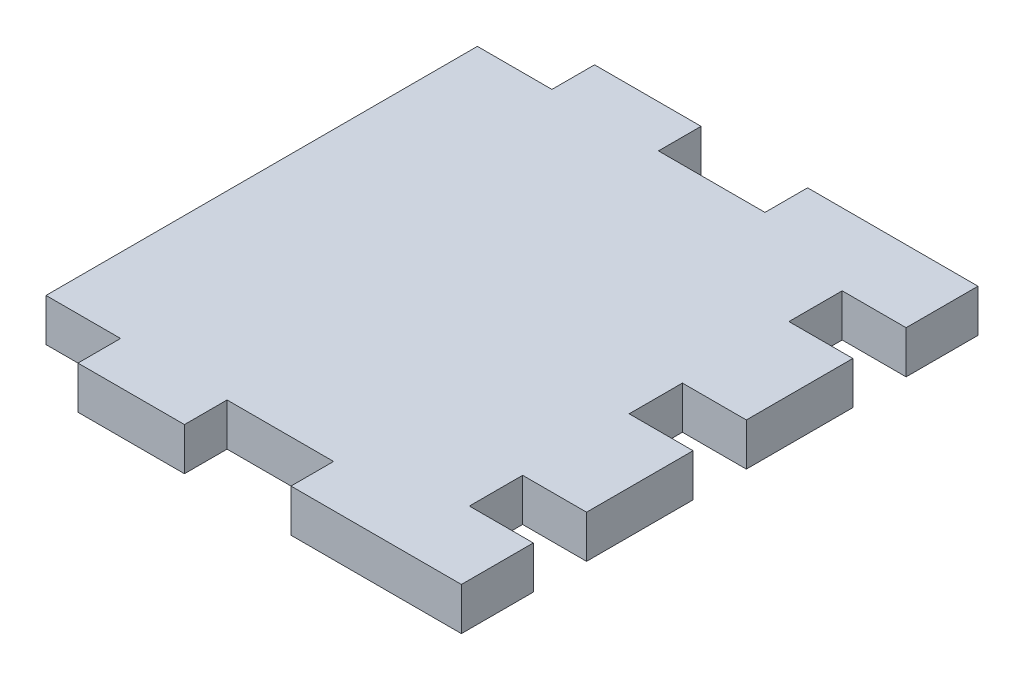
ISO-10303-21;
HEADER;
FILE_DESCRIPTION(('STEP AP214'),'2;1');
FILE_NAME('part.step','',(''),(''),'','','');
FILE_SCHEMA(('AUTOMOTIVE_DESIGN { 1 0 10303 214 1 1 1 1 }'));
ENDSEC;
DATA;
#1=APPLICATION_CONTEXT('core data for automotive mechanical design processes');
#2=APPLICATION_PROTOCOL_DEFINITION('international standard','automotive_design',2000,#1);
#3=PRODUCT_CONTEXT('',#1,'mechanical');
#4=PRODUCT('Part','Part','',(#3));
#5=PRODUCT_RELATED_PRODUCT_CATEGORY('part','',(#4));
#6=PRODUCT_DEFINITION_FORMATION('','',#4);
#7=PRODUCT_DEFINITION_CONTEXT('part definition',#1,'design');
#8=PRODUCT_DEFINITION('design','',#6,#7);
#9=PRODUCT_DEFINITION_SHAPE('','',#8);
#10=(LENGTH_UNIT() NAMED_UNIT(*) SI_UNIT(.MILLI.,.METRE.));
#11=(NAMED_UNIT(*) PLANE_ANGLE_UNIT() SI_UNIT($,.RADIAN.));
#12=(NAMED_UNIT(*) SI_UNIT($,.STERADIAN.) SOLID_ANGLE_UNIT());
#13=UNCERTAINTY_MEASURE_WITH_UNIT(LENGTH_MEASURE(1.E-05),#10,'distance_accuracy_value','');
#14=(GEOMETRIC_REPRESENTATION_CONTEXT(3) GLOBAL_UNCERTAINTY_ASSIGNED_CONTEXT((#13)) GLOBAL_UNIT_ASSIGNED_CONTEXT((#10,
#11,#12)) REPRESENTATION_CONTEXT('',''));
#15=CARTESIAN_POINT('',(0.,0.,0.));
#16=DIRECTION('',(0.,0.,1.));
#17=DIRECTION('',(1.,0.,0.));
#18=AXIS2_PLACEMENT_3D('',#15,#16,#17);
#19=CARTESIAN_POINT('',(37.,4.,0.));
#20=DIRECTION('',(-1.,0.,0.));
#21=DIRECTION('',(0.,0.,1.));
#22=AXIS2_PLACEMENT_3D('',#19,#20,#21);
#23=PLANE('',#22);
#24=DIRECTION('',(0.,1.,0.));
#25=VECTOR('',#24,1.);
#26=CARTESIAN_POINT('',(37.,4.,37.75));
#27=LINE('',#26,#25);
#28=CARTESIAN_POINT('',(37.,0.,37.75));
#29=VERTEX_POINT('',#28);
#30=CARTESIAN_POINT('',(37.,4.,37.75));
#31=VERTEX_POINT('',#30);
#32=EDGE_CURVE('E53',#29,#31,#27,.T.);
#33=ORIENTED_EDGE('',*,*,#32,.F.);
#34=DIRECTION('',(0.,0.,-1.));
#35=VECTOR('',#34,1.);
#36=CARTESIAN_POINT('',(37.,0.,0.));
#37=LINE('',#36,#35);
#38=CARTESIAN_POINT('',(37.,0.,32.75));
#39=VERTEX_POINT('',#38);
#40=EDGE_CURVE('E425',#29,#39,#37,.T.);
#41=ORIENTED_EDGE('',*,*,#40,.T.);
#42=DIRECTION('',(0.,-1.,0.));
#43=VECTOR('',#42,1.);
#44=CARTESIAN_POINT('',(37.,4.,32.75));
#45=LINE('',#44,#43);
#46=CARTESIAN_POINT('',(37.,4.,32.75));
#47=VERTEX_POINT('',#46);
#48=EDGE_CURVE('E244',#47,#39,#45,.T.);
#49=ORIENTED_EDGE('',*,*,#48,.F.);
#50=DIRECTION('',(0.,0.,-1.));
#51=VECTOR('',#50,1.);
#52=CARTESIAN_POINT('',(37.,4.,0.));
#53=LINE('',#52,#51);
#54=EDGE_CURVE('E48',#31,#47,#53,.T.);
#55=ORIENTED_EDGE('',*,*,#54,.F.);
#56=EDGE_LOOP('',(#33,#41,#49,#55));
#57=FACE_BOUND('',#56,.T.);
#58=ADVANCED_FACE('F33',(#57),#23,.F.);
#59=DIRECTION('',(0.,1.,0.));
#60=VECTOR('',#59,1.);
#61=CARTESIAN_POINT('',(37.,4.,22.75));
#62=LINE('',#61,#60);
#63=CARTESIAN_POINT('',(37.,0.,22.75));
#64=VERTEX_POINT('',#63);
#65=CARTESIAN_POINT('',(37.,4.,22.75));
#66=VERTEX_POINT('',#65);
#67=EDGE_CURVE('E240',#64,#66,#62,.T.);
#68=ORIENTED_EDGE('',*,*,#67,.F.);
#69=CARTESIAN_POINT('',(37.,0.,17.75));
#70=VERTEX_POINT('',#69);
#71=EDGE_CURVE('E428',#64,#70,#37,.T.);
#72=ORIENTED_EDGE('',*,*,#71,.T.);
#73=DIRECTION('',(0.,-1.,0.));
#74=VECTOR('',#73,1.);
#75=CARTESIAN_POINT('',(37.,0.,17.75));
#76=LINE('',#75,#74);
#77=CARTESIAN_POINT('',(37.,4.,17.75));
#78=VERTEX_POINT('',#77);
#79=EDGE_CURVE('E272',#78,#70,#76,.T.);
#80=ORIENTED_EDGE('',*,*,#79,.F.);
#81=EDGE_CURVE('E415',#66,#78,#53,.T.);
#82=ORIENTED_EDGE('',*,*,#81,.F.);
#83=EDGE_LOOP('',(#68,#72,#80,#82));
#84=FACE_BOUND('',#83,.T.);
#85=ADVANCED_FACE('F498',(#84),#23,.F.);
#86=DIRECTION('',(0.,1.,0.));
#87=VECTOR('',#86,1.);
#88=CARTESIAN_POINT('',(37.,0.,7.75000000000002));
#89=LINE('',#88,#87);
#90=CARTESIAN_POINT('',(37.,0.,7.75000000000002));
#91=VERTEX_POINT('',#90);
#92=CARTESIAN_POINT('',(37.,4.,7.75000000000002));
#93=VERTEX_POINT('',#92);
#94=EDGE_CURVE('E277',#91,#93,#89,.T.);
#95=ORIENTED_EDGE('',*,*,#94,.F.);
#96=CARTESIAN_POINT('',(37.,0.,2.75000000000002));
#97=VERTEX_POINT('',#96);
#98=EDGE_CURVE('E424',#91,#97,#37,.T.);
#99=ORIENTED_EDGE('',*,*,#98,.T.);
#100=DIRECTION('',(0.,-1.,0.));
#101=VECTOR('',#100,1.);
#102=CARTESIAN_POINT('',(37.,0.,2.75000000000002));
#103=LINE('',#102,#101);
#104=CARTESIAN_POINT('',(37.,4.,2.75000000000002));
#105=VERTEX_POINT('',#104);
#106=EDGE_CURVE('E299',#105,#97,#103,.T.);
#107=ORIENTED_EDGE('',*,*,#106,.F.);
#108=EDGE_CURVE('E412',#93,#105,#53,.T.);
#109=ORIENTED_EDGE('',*,*,#108,.F.);
#110=EDGE_LOOP('',(#95,#99,#107,#109));
#111=FACE_BOUND('',#110,.T.);
#112=ADVANCED_FACE('F482',(#111),#23,.F.);
#113=CARTESIAN_POINT('',(0.,4.,40.5));
#114=DIRECTION('',(0.,0.,-1.));
#115=DIRECTION('',(-1.,0.,0.));
#116=AXIS2_PLACEMENT_3D('',#113,#114,#115);
#117=PLANE('',#116);
#118=DIRECTION('',(1.,0.,0.));
#119=VECTOR('',#118,1.);
#120=CARTESIAN_POINT('',(0.,4.,40.5));
#121=LINE('',#120,#119);
#122=CARTESIAN_POINT('',(17.,4.,40.5));
#123=VERTEX_POINT('',#122);
#124=CARTESIAN_POINT('',(27.,4.,40.5));
#125=VERTEX_POINT('',#124);
#126=EDGE_CURVE('E407',#123,#125,#121,.T.);
#127=ORIENTED_EDGE('',*,*,#126,.F.);
#128=DIRECTION('',(0.,-1.,0.));
#129=VECTOR('',#128,1.);
#130=CARTESIAN_POINT('',(17.,4.,40.5));
#131=LINE('',#130,#129);
#132=CARTESIAN_POINT('',(17.,0.,40.5));
#133=VERTEX_POINT('',#132);
#134=EDGE_CURVE('E337',#123,#133,#131,.T.);
#135=ORIENTED_EDGE('',*,*,#134,.T.);
#136=DIRECTION('',(1.,0.,0.));
#137=VECTOR('',#136,1.);
#138=CARTESIAN_POINT('',(0.,0.,40.5));
#139=LINE('',#138,#137);
#140=CARTESIAN_POINT('',(27.,0.,40.5));
#141=VERTEX_POINT('',#140);
#142=EDGE_CURVE('E421',#133,#141,#139,.T.);
#143=ORIENTED_EDGE('',*,*,#142,.T.);
#144=DIRECTION('',(0.,-1.,0.));
#145=VECTOR('',#144,1.);
#146=CARTESIAN_POINT('',(27.,4.,40.5));
#147=LINE('',#146,#145);
#148=EDGE_CURVE('E385',#125,#141,#147,.T.);
#149=ORIENTED_EDGE('',*,*,#148,.F.);
#150=EDGE_LOOP('',(#127,#135,#143,#149));
#151=FACE_BOUND('',#150,.T.);
#152=ADVANCED_FACE('F522',(#151),#117,.F.);
#153=CARTESIAN_POINT('',(0.,4.,0.));
#154=DIRECTION('',(0.,0.,1.));
#155=DIRECTION('',(1.,0.,0.));
#156=AXIS2_PLACEMENT_3D('',#153,#154,#155);
#157=PLANE('',#156);
#158=DIRECTION('',(-1.,0.,0.));
#159=VECTOR('',#158,1.);
#160=CARTESIAN_POINT('',(0.,0.,0.));
#161=LINE('',#160,#159);
#162=CARTESIAN_POINT('',(27.,0.,0.));
#163=VERTEX_POINT('',#162);
#164=CARTESIAN_POINT('',(17.,0.,0.));
#165=VERTEX_POINT('',#164);
#166=EDGE_CURVE('E408',#163,#165,#161,.T.);
#167=ORIENTED_EDGE('',*,*,#166,.T.);
#168=DIRECTION('',(0.,-1.,0.));
#169=VECTOR('',#168,1.);
#170=CARTESIAN_POINT('',(17.,4.,0.));
#171=LINE('',#170,#169);
#172=CARTESIAN_POINT('',(17.,4.,0.));
#173=VERTEX_POINT('',#172);
#174=EDGE_CURVE('E357',#173,#165,#171,.T.);
#175=ORIENTED_EDGE('',*,*,#174,.F.);
#176=DIRECTION('',(-1.,0.,0.));
#177=VECTOR('',#176,1.);
#178=CARTESIAN_POINT('',(0.,4.,0.));
#179=LINE('',#178,#177);
#180=CARTESIAN_POINT('',(27.,4.,0.));
#181=VERTEX_POINT('',#180);
#182=EDGE_CURVE('E416',#181,#173,#179,.T.);
#183=ORIENTED_EDGE('',*,*,#182,.F.);
#184=DIRECTION('',(0.,-1.,0.));
#185=VECTOR('',#184,1.);
#186=CARTESIAN_POINT('',(27.,4.,0.));
#187=LINE('',#186,#185);
#188=EDGE_CURVE('E396',#181,#163,#187,.T.);
#189=ORIENTED_EDGE('',*,*,#188,.T.);
#190=EDGE_LOOP('',(#167,#175,#183,#189));
#191=FACE_BOUND('',#190,.T.);
#192=ADVANCED_FACE('F459',(#191),#157,.F.);
#193=CARTESIAN_POINT('',(0.,0.,40.5));
#194=VERTEX_POINT('',#193);
#195=CARTESIAN_POINT('',(7.,0.,40.5));
#196=VERTEX_POINT('',#195);
#197=EDGE_CURVE('E422',#194,#196,#139,.T.);
#198=ORIENTED_EDGE('',*,*,#197,.T.);
#199=DIRECTION('',(0.,-1.,0.));
#200=VECTOR('',#199,1.);
#201=CARTESIAN_POINT('',(7.,4.,40.5));
#202=LINE('',#201,#200);
#203=CARTESIAN_POINT('',(7.,4.,40.5));
#204=VERTEX_POINT('',#203);
#205=EDGE_CURVE('E341',#204,#196,#202,.T.);
#206=ORIENTED_EDGE('',*,*,#205,.F.);
#207=CARTESIAN_POINT('',(0.,4.,40.5));
#208=VERTEX_POINT('',#207);
#209=EDGE_CURVE('E409',#208,#204,#121,.T.);
#210=ORIENTED_EDGE('',*,*,#209,.F.);
#211=DIRECTION('',(0.,-1.,0.));
#212=VECTOR('',#211,1.);
#213=CARTESIAN_POINT('',(0.,4.,40.5));
#214=LINE('',#213,#212);
#215=EDGE_CURVE('E11',#208,#194,#214,.T.);
#216=ORIENTED_EDGE('',*,*,#215,.T.);
#217=EDGE_LOOP('',(#198,#206,#210,#216));
#218=FACE_BOUND('',#217,.T.);
#219=ADVANCED_FACE('F440',(#218),#117,.F.);
#220=CARTESIAN_POINT('',(0.,4.,0.));
#221=DIRECTION('',(1.,0.,0.));
#222=DIRECTION('',(0.,0.,-1.));
#223=AXIS2_PLACEMENT_3D('',#220,#221,#222);
#224=PLANE('',#223);
#225=DIRECTION('',(0.,0.,1.));
#226=VECTOR('',#225,1.);
#227=CARTESIAN_POINT('',(0.,0.,0.));
#228=LINE('',#227,#226);
#229=CARTESIAN_POINT('',(0.,0.,0.));
#230=VERTEX_POINT('',#229);
#231=EDGE_CURVE('E402',#230,#194,#228,.T.);
#232=ORIENTED_EDGE('',*,*,#231,.T.);
#233=ORIENTED_EDGE('',*,*,#215,.F.);
#234=DIRECTION('',(0.,0.,1.));
#235=VECTOR('',#234,1.);
#236=CARTESIAN_POINT('',(0.,4.,0.));
#237=LINE('',#236,#235);
#238=CARTESIAN_POINT('',(0.,4.,0.));
#239=VERTEX_POINT('',#238);
#240=EDGE_CURVE('E405',#239,#208,#237,.T.);
#241=ORIENTED_EDGE('',*,*,#240,.F.);
#242=DIRECTION('',(0.,-1.,0.));
#243=VECTOR('',#242,1.);
#244=CARTESIAN_POINT('',(0.,4.,0.));
#245=LINE('',#244,#243);
#246=EDGE_CURVE('E41',#239,#230,#245,.T.);
#247=ORIENTED_EDGE('',*,*,#246,.T.);
#248=EDGE_LOOP('',(#232,#233,#241,#247));
#249=FACE_BOUND('',#248,.T.);
#250=ADVANCED_FACE('F35',(#249),#224,.F.);
#251=CARTESIAN_POINT('',(7.,4.,0.));
#252=VERTEX_POINT('',#251);
#253=EDGE_CURVE('E414',#252,#239,#179,.T.);
#254=ORIENTED_EDGE('',*,*,#253,.F.);
#255=DIRECTION('',(0.,-1.,0.));
#256=VECTOR('',#255,1.);
#257=CARTESIAN_POINT('',(7.,4.,0.));
#258=LINE('',#257,#256);
#259=CARTESIAN_POINT('',(7.,0.,0.));
#260=VERTEX_POINT('',#259);
#261=EDGE_CURVE('E370',#252,#260,#258,.T.);
#262=ORIENTED_EDGE('',*,*,#261,.T.);
#263=EDGE_CURVE('E427',#260,#230,#161,.T.);
#264=ORIENTED_EDGE('',*,*,#263,.T.);
#265=ORIENTED_EDGE('',*,*,#246,.F.);
#266=EDGE_LOOP('',(#254,#262,#264,#265));
#267=FACE_BOUND('',#266,.T.);
#268=ADVANCED_FACE('F445',(#267),#157,.F.);
#269=CARTESIAN_POINT('',(0.,4.,0.));
#270=DIRECTION('',(0.,1.,0.));
#271=DIRECTION('',(0.,0.,1.));
#272=AXIS2_PLACEMENT_3D('',#269,#270,#271);
#273=PLANE('',#272);
#274=ORIENTED_EDGE('',*,*,#240,.T.);
#275=ORIENTED_EDGE('',*,*,#209,.T.);
#276=DIRECTION('',(0.,0.,-1.));
#277=VECTOR('',#276,1.);
#278=CARTESIAN_POINT('',(7.,4.,40.5));
#279=LINE('',#278,#277);
#280=CARTESIAN_POINT('',(7.,4.,44.5));
#281=VERTEX_POINT('',#280);
#282=EDGE_CURVE('E326',#281,#204,#279,.T.);
#283=ORIENTED_EDGE('',*,*,#282,.F.);
#284=DIRECTION('',(-1.,0.,0.));
#285=VECTOR('',#284,1.);
#286=CARTESIAN_POINT('',(17.,4.,44.5));
#287=LINE('',#286,#285);
#288=CARTESIAN_POINT('',(17.,4.,44.5));
#289=VERTEX_POINT('',#288);
#290=EDGE_CURVE('E322',#289,#281,#287,.T.);
#291=ORIENTED_EDGE('',*,*,#290,.F.);
#292=DIRECTION('',(0.,0.,1.));
#293=VECTOR('',#292,1.);
#294=CARTESIAN_POINT('',(17.,4.,40.5));
#295=LINE('',#294,#293);
#296=EDGE_CURVE('E319',#123,#289,#295,.T.);
#297=ORIENTED_EDGE('',*,*,#296,.F.);
#298=ORIENTED_EDGE('',*,*,#126,.T.);
#299=DIRECTION('',(0.,0.,-1.));
#300=VECTOR('',#299,1.);
#301=CARTESIAN_POINT('',(27.,4.,40.5));
#302=LINE('',#301,#300);
#303=CARTESIAN_POINT('',(27.,4.,44.5));
#304=VERTEX_POINT('',#303);
#305=EDGE_CURVE('E376',#304,#125,#302,.T.);
#306=ORIENTED_EDGE('',*,*,#305,.F.);
#307=DIRECTION('',(-1.,0.,0.));
#308=VECTOR('',#307,1.);
#309=CARTESIAN_POINT('',(37.,4.,44.5));
#310=LINE('',#309,#308);
#311=CARTESIAN_POINT('',(43.,4.,44.5));
#312=VERTEX_POINT('',#311);
#313=EDGE_CURVE('E224',#312,#304,#310,.T.);
#314=ORIENTED_EDGE('',*,*,#313,.F.);
#315=DIRECTION('',(0.,0.,1.));
#316=VECTOR('',#315,1.);
#317=CARTESIAN_POINT('',(43.,4.,37.75));
#318=LINE('',#317,#316);
#319=CARTESIAN_POINT('',(43.,4.,37.75));
#320=VERTEX_POINT('',#319);
#321=EDGE_CURVE('E216',#320,#312,#318,.T.);
#322=ORIENTED_EDGE('',*,*,#321,.F.);
#323=DIRECTION('',(-1.,0.,0.));
#324=VECTOR('',#323,1.);
#325=CARTESIAN_POINT('',(43.,4.,37.75));
#326=LINE('',#325,#324);
#327=EDGE_CURVE('E221',#320,#31,#326,.T.);
#328=ORIENTED_EDGE('',*,*,#327,.T.);
#329=ORIENTED_EDGE('',*,*,#54,.T.);
#330=DIRECTION('',(-1.,0.,0.));
#331=VECTOR('',#330,1.);
#332=CARTESIAN_POINT('',(43.,4.,32.75));
#333=LINE('',#332,#331);
#334=CARTESIAN_POINT('',(43.,4.,32.75));
#335=VERTEX_POINT('',#334);
#336=EDGE_CURVE('E266',#335,#47,#333,.T.);
#337=ORIENTED_EDGE('',*,*,#336,.F.);
#338=DIRECTION('',(0.,0.,1.));
#339=VECTOR('',#338,1.);
#340=CARTESIAN_POINT('',(43.,4.,22.75));
#341=LINE('',#340,#339);
#342=CARTESIAN_POINT('',(43.,4.,22.75));
#343=VERTEX_POINT('',#342);
#344=EDGE_CURVE('E252',#343,#335,#341,.T.);
#345=ORIENTED_EDGE('',*,*,#344,.F.);
#346=DIRECTION('',(-1.,0.,0.));
#347=VECTOR('',#346,1.);
#348=CARTESIAN_POINT('',(43.,4.,22.75));
#349=LINE('',#348,#347);
#350=EDGE_CURVE('E269',#343,#66,#349,.T.);
#351=ORIENTED_EDGE('',*,*,#350,.T.);
#352=ORIENTED_EDGE('',*,*,#81,.T.);
#353=DIRECTION('',(-1.,0.,0.));
#354=VECTOR('',#353,1.);
#355=CARTESIAN_POINT('',(43.,4.,17.75));
#356=LINE('',#355,#354);
#357=CARTESIAN_POINT('',(43.,4.,17.75));
#358=VERTEX_POINT('',#357);
#359=EDGE_CURVE('E283',#358,#78,#356,.T.);
#360=ORIENTED_EDGE('',*,*,#359,.F.);
#361=DIRECTION('',(0.,0.,1.));
#362=VECTOR('',#361,1.);
#363=CARTESIAN_POINT('',(43.,4.,17.75));
#364=LINE('',#363,#362);
#365=CARTESIAN_POINT('',(43.,4.,7.75000000000002));
#366=VERTEX_POINT('',#365);
#367=EDGE_CURVE('E281',#366,#358,#364,.T.);
#368=ORIENTED_EDGE('',*,*,#367,.F.);
#369=DIRECTION('',(-1.,0.,0.));
#370=VECTOR('',#369,1.);
#371=CARTESIAN_POINT('',(43.,4.,7.75000000000002));
#372=LINE('',#371,#370);
#373=EDGE_CURVE('E290',#366,#93,#372,.T.);
#374=ORIENTED_EDGE('',*,*,#373,.T.);
#375=ORIENTED_EDGE('',*,*,#108,.T.);
#376=DIRECTION('',(-1.,0.,0.));
#377=VECTOR('',#376,1.);
#378=CARTESIAN_POINT('',(43.,4.,2.75000000000002));
#379=LINE('',#378,#377);
#380=CARTESIAN_POINT('',(43.,4.,2.75000000000002));
#381=VERTEX_POINT('',#380);
#382=EDGE_CURVE('E315',#381,#105,#379,.T.);
#383=ORIENTED_EDGE('',*,*,#382,.F.);
#384=DIRECTION('',(0.,0.,1.));
#385=VECTOR('',#384,1.);
#386=CARTESIAN_POINT('',(43.,4.,-4.));
#387=LINE('',#386,#385);
#388=CARTESIAN_POINT('',(43.,4.,-4.));
#389=VERTEX_POINT('',#388);
#390=EDGE_CURVE('E303',#389,#381,#387,.T.);
#391=ORIENTED_EDGE('',*,*,#390,.F.);
#392=DIRECTION('',(1.,0.,0.));
#393=VECTOR('',#392,1.);
#394=CARTESIAN_POINT('',(37.,4.,-4.));
#395=LINE('',#394,#393);
#396=CARTESIAN_POINT('',(27.,4.,-4.));
#397=VERTEX_POINT('',#396);
#398=EDGE_CURVE('E393',#397,#389,#395,.T.);
#399=ORIENTED_EDGE('',*,*,#398,.F.);
#400=DIRECTION('',(0.,0.,-1.));
#401=VECTOR('',#400,1.);
#402=CARTESIAN_POINT('',(27.,4.,0.));
#403=LINE('',#402,#401);
#404=EDGE_CURVE('E390',#181,#397,#403,.T.);
#405=ORIENTED_EDGE('',*,*,#404,.F.);
#406=ORIENTED_EDGE('',*,*,#182,.T.);
#407=DIRECTION('',(0.,0.,1.));
#408=VECTOR('',#407,1.);
#409=CARTESIAN_POINT('',(17.,4.,0.));
#410=LINE('',#409,#408);
#411=CARTESIAN_POINT('',(17.,4.,-4.));
#412=VERTEX_POINT('',#411);
#413=EDGE_CURVE('E347',#412,#173,#410,.T.);
#414=ORIENTED_EDGE('',*,*,#413,.F.);
#415=DIRECTION('',(1.,0.,0.));
#416=VECTOR('',#415,1.);
#417=CARTESIAN_POINT('',(17.,4.,-4.));
#418=LINE('',#417,#416);
#419=CARTESIAN_POINT('',(7.,4.,-4.));
#420=VERTEX_POINT('',#419);
#421=EDGE_CURVE('E354',#420,#412,#418,.T.);
#422=ORIENTED_EDGE('',*,*,#421,.F.);
#423=DIRECTION('',(0.,0.,-1.));
#424=VECTOR('',#423,1.);
#425=CARTESIAN_POINT('',(7.,4.,0.));
#426=LINE('',#425,#424);
#427=EDGE_CURVE('E350',#252,#420,#426,.T.);
#428=ORIENTED_EDGE('',*,*,#427,.F.);
#429=ORIENTED_EDGE('',*,*,#253,.T.);
#430=EDGE_LOOP('',(#274,#275,#283,#291,#297,#298,#306,#314,#322,#328,#329,#337,#345,#351,#352,
#360,#368,#374,#375,#383,#391,#399,#405,#406,#414,#422,#428,#429));
#431=FACE_BOUND('',#430,.T.);
#432=ADVANCED_FACE('F219',(#431),#273,.T.);
#433=CARTESIAN_POINT('',(0.,0.,0.));
#434=DIRECTION('',(0.,1.,0.));
#435=DIRECTION('',(0.,0.,1.));
#436=AXIS2_PLACEMENT_3D('',#433,#434,#435);
#437=PLANE('',#436);
#438=ORIENTED_EDGE('',*,*,#231,.F.);
#439=ORIENTED_EDGE('',*,*,#263,.F.);
#440=DIRECTION('',(0.,0.,-1.));
#441=VECTOR('',#440,1.);
#442=CARTESIAN_POINT('',(7.,0.,0.));
#443=LINE('',#442,#441);
#444=CARTESIAN_POINT('',(7.,0.,-4.));
#445=VERTEX_POINT('',#444);
#446=EDGE_CURVE('E360',#260,#445,#443,.T.);
#447=ORIENTED_EDGE('',*,*,#446,.T.);
#448=DIRECTION('',(1.,0.,0.));
#449=VECTOR('',#448,1.);
#450=CARTESIAN_POINT('',(17.,0.,-4.));
#451=LINE('',#450,#449);
#452=CARTESIAN_POINT('',(17.,0.,-4.));
#453=VERTEX_POINT('',#452);
#454=EDGE_CURVE('E351',#445,#453,#451,.T.);
#455=ORIENTED_EDGE('',*,*,#454,.T.);
#456=DIRECTION('',(0.,0.,1.));
#457=VECTOR('',#456,1.);
#458=CARTESIAN_POINT('',(17.,0.,0.));
#459=LINE('',#458,#457);
#460=EDGE_CURVE('E340',#453,#165,#459,.T.);
#461=ORIENTED_EDGE('',*,*,#460,.T.);
#462=ORIENTED_EDGE('',*,*,#166,.F.);
#463=DIRECTION('',(0.,0.,-1.));
#464=VECTOR('',#463,1.);
#465=CARTESIAN_POINT('',(27.,0.,0.));
#466=LINE('',#465,#464);
#467=CARTESIAN_POINT('',(27.,0.,-4.));
#468=VERTEX_POINT('',#467);
#469=EDGE_CURVE('E388',#163,#468,#466,.T.);
#470=ORIENTED_EDGE('',*,*,#469,.T.);
#471=DIRECTION('',(1.,0.,0.));
#472=VECTOR('',#471,1.);
#473=CARTESIAN_POINT('',(37.,0.,-4.));
#474=LINE('',#473,#472);
#475=CARTESIAN_POINT('',(43.,0.,-4.));
#476=VERTEX_POINT('',#475);
#477=EDGE_CURVE('E394',#468,#476,#474,.T.);
#478=ORIENTED_EDGE('',*,*,#477,.T.);
#479=DIRECTION('',(0.,0.,-1.));
#480=VECTOR('',#479,1.);
#481=CARTESIAN_POINT('',(43.,0.,-4.));
#482=LINE('',#481,#480);
#483=CARTESIAN_POINT('',(43.,0.,2.75000000000002));
#484=VERTEX_POINT('',#483);
#485=EDGE_CURVE('E307',#484,#476,#482,.T.);
#486=ORIENTED_EDGE('',*,*,#485,.F.);
#487=DIRECTION('',(-1.,0.,0.));
#488=VECTOR('',#487,1.);
#489=CARTESIAN_POINT('',(43.,0.,2.75000000000002));
#490=LINE('',#489,#488);
#491=EDGE_CURVE('E310',#484,#97,#490,.T.);
#492=ORIENTED_EDGE('',*,*,#491,.T.);
#493=ORIENTED_EDGE('',*,*,#98,.F.);
#494=DIRECTION('',(-1.,0.,0.));
#495=VECTOR('',#494,1.);
#496=CARTESIAN_POINT('',(43.,0.,7.75000000000002));
#497=LINE('',#496,#495);
#498=CARTESIAN_POINT('',(43.,0.,7.75000000000002));
#499=VERTEX_POINT('',#498);
#500=EDGE_CURVE('E293',#499,#91,#497,.T.);
#501=ORIENTED_EDGE('',*,*,#500,.F.);
#502=DIRECTION('',(0.,0.,-1.));
#503=VECTOR('',#502,1.);
#504=CARTESIAN_POINT('',(43.,0.,17.75));
#505=LINE('',#504,#503);
#506=CARTESIAN_POINT('',(43.,0.,17.75));
#507=VERTEX_POINT('',#506);
#508=EDGE_CURVE('E276',#507,#499,#505,.T.);
#509=ORIENTED_EDGE('',*,*,#508,.F.);
#510=DIRECTION('',(-1.,0.,0.));
#511=VECTOR('',#510,1.);
#512=CARTESIAN_POINT('',(43.,0.,17.75));
#513=LINE('',#512,#511);
#514=EDGE_CURVE('E296',#507,#70,#513,.T.);
#515=ORIENTED_EDGE('',*,*,#514,.T.);
#516=ORIENTED_EDGE('',*,*,#71,.F.);
#517=DIRECTION('',(-1.,0.,0.));
#518=VECTOR('',#517,1.);
#519=CARTESIAN_POINT('',(43.,0.,22.75));
#520=LINE('',#519,#518);
#521=CARTESIAN_POINT('',(43.,0.,22.75));
#522=VERTEX_POINT('',#521);
#523=EDGE_CURVE('E257',#522,#64,#520,.T.);
#524=ORIENTED_EDGE('',*,*,#523,.F.);
#525=DIRECTION('',(0.,0.,-1.));
#526=VECTOR('',#525,1.);
#527=CARTESIAN_POINT('',(43.,0.,22.75));
#528=LINE('',#527,#526);
#529=CARTESIAN_POINT('',(43.,0.,32.75));
#530=VERTEX_POINT('',#529);
#531=EDGE_CURVE('E256',#530,#522,#528,.T.);
#532=ORIENTED_EDGE('',*,*,#531,.F.);
#533=DIRECTION('',(-1.,0.,0.));
#534=VECTOR('',#533,1.);
#535=CARTESIAN_POINT('',(43.,0.,32.75));
#536=LINE('',#535,#534);
#537=EDGE_CURVE('E263',#530,#39,#536,.T.);
#538=ORIENTED_EDGE('',*,*,#537,.T.);
#539=ORIENTED_EDGE('',*,*,#40,.F.);
#540=DIRECTION('',(-1.,0.,0.));
#541=VECTOR('',#540,1.);
#542=CARTESIAN_POINT('',(43.,0.,37.75));
#543=LINE('',#542,#541);
#544=CARTESIAN_POINT('',(43.,0.,37.75));
#545=VERTEX_POINT('',#544);
#546=EDGE_CURVE('E241',#545,#29,#543,.T.);
#547=ORIENTED_EDGE('',*,*,#546,.F.);
#548=DIRECTION('',(0.,0.,-1.));
#549=VECTOR('',#548,1.);
#550=CARTESIAN_POINT('',(43.,0.,37.75));
#551=LINE('',#550,#549);
#552=CARTESIAN_POINT('',(43.,0.,44.5));
#553=VERTEX_POINT('',#552);
#554=EDGE_CURVE('E234',#553,#545,#551,.T.);
#555=ORIENTED_EDGE('',*,*,#554,.F.);
#556=DIRECTION('',(-1.,0.,0.));
#557=VECTOR('',#556,1.);
#558=CARTESIAN_POINT('',(37.,0.,44.5));
#559=LINE('',#558,#557);
#560=CARTESIAN_POINT('',(27.,0.,44.5));
#561=VERTEX_POINT('',#560);
#562=EDGE_CURVE('E367',#553,#561,#559,.T.);
#563=ORIENTED_EDGE('',*,*,#562,.T.);
#564=DIRECTION('',(0.,0.,-1.));
#565=VECTOR('',#564,1.);
#566=CARTESIAN_POINT('',(27.,0.,40.5));
#567=LINE('',#566,#565);
#568=EDGE_CURVE('E377',#561,#141,#567,.T.);
#569=ORIENTED_EDGE('',*,*,#568,.T.);
#570=ORIENTED_EDGE('',*,*,#142,.F.);
#571=DIRECTION('',(0.,0.,1.));
#572=VECTOR('',#571,1.);
#573=CARTESIAN_POINT('',(17.,0.,40.5));
#574=LINE('',#573,#572);
#575=CARTESIAN_POINT('',(17.,0.,44.5));
#576=VERTEX_POINT('',#575);
#577=EDGE_CURVE('E318',#133,#576,#574,.T.);
#578=ORIENTED_EDGE('',*,*,#577,.T.);
#579=DIRECTION('',(-1.,0.,0.));
#580=VECTOR('',#579,1.);
#581=CARTESIAN_POINT('',(17.,0.,44.5));
#582=LINE('',#581,#580);
#583=CARTESIAN_POINT('',(7.,0.,44.5));
#584=VERTEX_POINT('',#583);
#585=EDGE_CURVE('E332',#576,#584,#582,.T.);
#586=ORIENTED_EDGE('',*,*,#585,.T.);
#587=DIRECTION('',(0.,0.,-1.));
#588=VECTOR('',#587,1.);
#589=CARTESIAN_POINT('',(7.,0.,40.5));
#590=LINE('',#589,#588);
#591=EDGE_CURVE('E323',#584,#196,#590,.T.);
#592=ORIENTED_EDGE('',*,*,#591,.T.);
#593=ORIENTED_EDGE('',*,*,#197,.F.);
#594=EDGE_LOOP('',(#438,#439,#447,#455,#461,#462,#470,#478,#486,#492,#493,#501,#509,#515,#516,
#524,#532,#538,#539,#547,#555,#563,#569,#570,#578,#586,#592,#593));
#595=FACE_BOUND('',#594,.T.);
#596=ADVANCED_FACE('F437',(#595),#437,.F.);
#597=CARTESIAN_POINT('',(37.,4.,-4.));
#598=DIRECTION('',(0.,0.,-1.));
#599=DIRECTION('',(-1.,0.,0.));
#600=AXIS2_PLACEMENT_3D('',#597,#598,#599);
#601=PLANE('',#600);
#602=ORIENTED_EDGE('',*,*,#477,.F.);
#603=DIRECTION('',(0.,-1.,0.));
#604=VECTOR('',#603,1.);
#605=CARTESIAN_POINT('',(27.,4.,-4.));
#606=LINE('',#605,#604);
#607=EDGE_CURVE('E400',#397,#468,#606,.T.);
#608=ORIENTED_EDGE('',*,*,#607,.F.);
#609=ORIENTED_EDGE('',*,*,#398,.T.);
#610=DIRECTION('',(0.,1.,0.));
#611=VECTOR('',#610,1.);
#612=CARTESIAN_POINT('',(43.,0.,-4.));
#613=LINE('',#612,#611);
#614=EDGE_CURVE('E300',#476,#389,#613,.T.);
#615=ORIENTED_EDGE('',*,*,#614,.F.);
#616=EDGE_LOOP('',(#602,#608,#609,#615));
#617=FACE_BOUND('',#616,.T.);
#618=ADVANCED_FACE('F469',(#617),#601,.T.);
#619=CARTESIAN_POINT('',(27.,4.,0.));
#620=DIRECTION('',(-1.,0.,0.));
#621=DIRECTION('',(0.,0.,1.));
#622=AXIS2_PLACEMENT_3D('',#619,#620,#621);
#623=PLANE('',#622);
#624=ORIENTED_EDGE('',*,*,#469,.F.);
#625=ORIENTED_EDGE('',*,*,#188,.F.);
#626=ORIENTED_EDGE('',*,*,#404,.T.);
#627=ORIENTED_EDGE('',*,*,#607,.T.);
#628=EDGE_LOOP('',(#624,#625,#626,#627));
#629=FACE_BOUND('',#628,.T.);
#630=ADVANCED_FACE('F463',(#629),#623,.T.);
#631=CARTESIAN_POINT('',(27.,4.,40.5));
#632=DIRECTION('',(-1.,0.,0.));
#633=DIRECTION('',(0.,0.,1.));
#634=AXIS2_PLACEMENT_3D('',#631,#632,#633);
#635=PLANE('',#634);
#636=ORIENTED_EDGE('',*,*,#568,.F.);
#637=DIRECTION('',(0.,-1.,0.));
#638=VECTOR('',#637,1.);
#639=CARTESIAN_POINT('',(27.,4.,44.5));
#640=LINE('',#639,#638);
#641=EDGE_CURVE('E380',#304,#561,#640,.T.);
#642=ORIENTED_EDGE('',*,*,#641,.F.);
#643=ORIENTED_EDGE('',*,*,#305,.T.);
#644=ORIENTED_EDGE('',*,*,#148,.T.);
#645=EDGE_LOOP('',(#636,#642,#643,#644));
#646=FACE_BOUND('',#645,.T.);
#647=ADVANCED_FACE('F517',(#646),#635,.T.);
#648=CARTESIAN_POINT('',(37.,4.,44.5));
#649=DIRECTION('',(0.,0.,1.));
#650=DIRECTION('',(1.,0.,0.));
#651=AXIS2_PLACEMENT_3D('',#648,#649,#650);
#652=PLANE('',#651);
#653=ORIENTED_EDGE('',*,*,#562,.F.);
#654=DIRECTION('',(0.,-1.,0.));
#655=VECTOR('',#654,1.);
#656=CARTESIAN_POINT('',(43.,4.,44.5));
#657=LINE('',#656,#655);
#658=EDGE_CURVE('E228',#312,#553,#657,.T.);
#659=ORIENTED_EDGE('',*,*,#658,.F.);
#660=ORIENTED_EDGE('',*,*,#313,.T.);
#661=ORIENTED_EDGE('',*,*,#641,.T.);
#662=EDGE_LOOP('',(#653,#659,#660,#661));
#663=FACE_BOUND('',#662,.T.);
#664=ADVANCED_FACE('F514',(#663),#652,.T.);
#665=CARTESIAN_POINT('',(17.,4.,0.));
#666=DIRECTION('',(1.,0.,0.));
#667=DIRECTION('',(0.,0.,-1.));
#668=AXIS2_PLACEMENT_3D('',#665,#666,#667);
#669=PLANE('',#668);
#670=ORIENTED_EDGE('',*,*,#460,.F.);
#671=DIRECTION('',(0.,-1.,0.));
#672=VECTOR('',#671,1.);
#673=CARTESIAN_POINT('',(17.,4.,-4.));
#674=LINE('',#673,#672);
#675=EDGE_CURVE('E365',#412,#453,#674,.T.);
#676=ORIENTED_EDGE('',*,*,#675,.F.);
#677=ORIENTED_EDGE('',*,*,#413,.T.);
#678=ORIENTED_EDGE('',*,*,#174,.T.);
#679=EDGE_LOOP('',(#670,#676,#677,#678));
#680=FACE_BOUND('',#679,.T.);
#681=ADVANCED_FACE('F455',(#680),#669,.T.);
#682=CARTESIAN_POINT('',(17.,4.,-4.));
#683=DIRECTION('',(0.,0.,-1.));
#684=DIRECTION('',(-1.,0.,0.));
#685=AXIS2_PLACEMENT_3D('',#682,#683,#684);
#686=PLANE('',#685);
#687=ORIENTED_EDGE('',*,*,#454,.F.);
#688=DIRECTION('',(0.,-1.,0.));
#689=VECTOR('',#688,1.);
#690=CARTESIAN_POINT('',(7.,4.,-4.));
#691=LINE('',#690,#689);
#692=EDGE_CURVE('E368',#420,#445,#691,.T.);
#693=ORIENTED_EDGE('',*,*,#692,.F.);
#694=ORIENTED_EDGE('',*,*,#421,.T.);
#695=ORIENTED_EDGE('',*,*,#675,.T.);
#696=EDGE_LOOP('',(#687,#693,#694,#695));
#697=FACE_BOUND('',#696,.T.);
#698=ADVANCED_FACE('F451',(#697),#686,.T.);
#699=CARTESIAN_POINT('',(7.,4.,0.));
#700=DIRECTION('',(-1.,0.,0.));
#701=DIRECTION('',(0.,0.,1.));
#702=AXIS2_PLACEMENT_3D('',#699,#700,#701);
#703=PLANE('',#702);
#704=ORIENTED_EDGE('',*,*,#446,.F.);
#705=ORIENTED_EDGE('',*,*,#261,.F.);
#706=ORIENTED_EDGE('',*,*,#427,.T.);
#707=ORIENTED_EDGE('',*,*,#692,.T.);
#708=EDGE_LOOP('',(#704,#705,#706,#707));
#709=FACE_BOUND('',#708,.T.);
#710=ADVANCED_FACE('F448',(#709),#703,.T.);
#711=CARTESIAN_POINT('',(17.,4.,40.5));
#712=DIRECTION('',(1.,0.,0.));
#713=DIRECTION('',(0.,0.,-1.));
#714=AXIS2_PLACEMENT_3D('',#711,#712,#713);
#715=PLANE('',#714);
#716=ORIENTED_EDGE('',*,*,#577,.F.);
#717=ORIENTED_EDGE('',*,*,#134,.F.);
#718=ORIENTED_EDGE('',*,*,#296,.T.);
#719=DIRECTION('',(0.,-1.,0.));
#720=VECTOR('',#719,1.);
#721=CARTESIAN_POINT('',(17.,4.,44.5));
#722=LINE('',#721,#720);
#723=EDGE_CURVE('E329',#289,#576,#722,.T.);
#724=ORIENTED_EDGE('',*,*,#723,.T.);
#725=EDGE_LOOP('',(#716,#717,#718,#724));
#726=FACE_BOUND('',#725,.T.);
#727=ADVANCED_FACE('F525',(#726),#715,.T.);
#728=CARTESIAN_POINT('',(7.,4.,40.5));
#729=DIRECTION('',(-1.,0.,0.));
#730=DIRECTION('',(0.,0.,1.));
#731=AXIS2_PLACEMENT_3D('',#728,#729,#730);
#732=PLANE('',#731);
#733=ORIENTED_EDGE('',*,*,#591,.F.);
#734=DIRECTION('',(0.,-1.,0.));
#735=VECTOR('',#734,1.);
#736=CARTESIAN_POINT('',(7.,4.,44.5));
#737=LINE('',#736,#735);
#738=EDGE_CURVE('E344',#281,#584,#737,.T.);
#739=ORIENTED_EDGE('',*,*,#738,.F.);
#740=ORIENTED_EDGE('',*,*,#282,.T.);
#741=ORIENTED_EDGE('',*,*,#205,.T.);
#742=EDGE_LOOP('',(#733,#739,#740,#741));
#743=FACE_BOUND('',#742,.T.);
#744=ADVANCED_FACE('F531',(#743),#732,.T.);
#745=CARTESIAN_POINT('',(17.,4.,44.5));
#746=DIRECTION('',(0.,0.,1.));
#747=DIRECTION('',(1.,0.,0.));
#748=AXIS2_PLACEMENT_3D('',#745,#746,#747);
#749=PLANE('',#748);
#750=ORIENTED_EDGE('',*,*,#585,.F.);
#751=ORIENTED_EDGE('',*,*,#723,.F.);
#752=ORIENTED_EDGE('',*,*,#290,.T.);
#753=ORIENTED_EDGE('',*,*,#738,.T.);
#754=EDGE_LOOP('',(#750,#751,#752,#753));
#755=FACE_BOUND('',#754,.T.);
#756=ADVANCED_FACE('F529',(#755),#749,.T.);
#757=CARTESIAN_POINT('',(43.,0.,2.75000000000002));
#758=DIRECTION('',(0.,0.,-1.));
#759=DIRECTION('',(-1.,0.,0.));
#760=AXIS2_PLACEMENT_3D('',#757,#758,#759);
#761=PLANE('',#760);
#762=ORIENTED_EDGE('',*,*,#106,.T.);
#763=ORIENTED_EDGE('',*,*,#491,.F.);
#764=DIRECTION('',(0.,-1.,0.));
#765=VECTOR('',#764,1.);
#766=CARTESIAN_POINT('',(43.,0.,2.75000000000002));
#767=LINE('',#766,#765);
#768=EDGE_CURVE('E305',#381,#484,#767,.T.);
#769=ORIENTED_EDGE('',*,*,#768,.F.);
#770=ORIENTED_EDGE('',*,*,#382,.T.);
#771=EDGE_LOOP('',(#762,#763,#769,#770));
#772=FACE_BOUND('',#771,.T.);
#773=ADVANCED_FACE('F476',(#772),#761,.F.);
#774=CARTESIAN_POINT('',(43.,0.,0.));
#775=DIRECTION('',(1.,0.,0.));
#776=DIRECTION('',(0.,0.,-1.));
#777=AXIS2_PLACEMENT_3D('',#774,#775,#776);
#778=PLANE('',#777);
#779=ORIENTED_EDGE('',*,*,#614,.T.);
#780=ORIENTED_EDGE('',*,*,#390,.T.);
#781=ORIENTED_EDGE('',*,*,#768,.T.);
#782=ORIENTED_EDGE('',*,*,#485,.T.);
#783=EDGE_LOOP('',(#779,#780,#781,#782));
#784=FACE_BOUND('',#783,.T.);
#785=ADVANCED_FACE('F472',(#784),#778,.T.);
#786=CARTESIAN_POINT('',(43.,0.,17.75));
#787=DIRECTION('',(0.,0.,-1.));
#788=DIRECTION('',(-1.,0.,0.));
#789=AXIS2_PLACEMENT_3D('',#786,#787,#788);
#790=PLANE('',#789);
#791=ORIENTED_EDGE('',*,*,#79,.T.);
#792=ORIENTED_EDGE('',*,*,#514,.F.);
#793=DIRECTION('',(0.,-1.,0.));
#794=VECTOR('',#793,1.);
#795=CARTESIAN_POINT('',(43.,0.,17.75));
#796=LINE('',#795,#794);
#797=EDGE_CURVE('E273',#358,#507,#796,.T.);
#798=ORIENTED_EDGE('',*,*,#797,.F.);
#799=ORIENTED_EDGE('',*,*,#359,.T.);
#800=EDGE_LOOP('',(#791,#792,#798,#799));
#801=FACE_BOUND('',#800,.T.);
#802=ADVANCED_FACE('F496',(#801),#790,.F.);
#803=CARTESIAN_POINT('',(43.,0.,7.75000000000002));
#804=DIRECTION('',(0.,0.,1.));
#805=DIRECTION('',(1.,0.,0.));
#806=AXIS2_PLACEMENT_3D('',#803,#804,#805);
#807=PLANE('',#806);
#808=ORIENTED_EDGE('',*,*,#94,.T.);
#809=ORIENTED_EDGE('',*,*,#373,.F.);
#810=DIRECTION('',(0.,1.,0.));
#811=VECTOR('',#810,1.);
#812=CARTESIAN_POINT('',(43.,0.,7.75000000000002));
#813=LINE('',#812,#811);
#814=EDGE_CURVE('E279',#499,#366,#813,.T.);
#815=ORIENTED_EDGE('',*,*,#814,.F.);
#816=ORIENTED_EDGE('',*,*,#500,.T.);
#817=EDGE_LOOP('',(#808,#809,#815,#816));
#818=FACE_BOUND('',#817,.T.);
#819=ADVANCED_FACE('F485',(#818),#807,.F.);
#820=CARTESIAN_POINT('',(43.,0.,0.));
#821=DIRECTION('',(-1.,0.,0.));
#822=DIRECTION('',(0.,0.,1.));
#823=AXIS2_PLACEMENT_3D('',#820,#821,#822);
#824=PLANE('',#823);
#825=ORIENTED_EDGE('',*,*,#797,.T.);
#826=ORIENTED_EDGE('',*,*,#508,.T.);
#827=ORIENTED_EDGE('',*,*,#814,.T.);
#828=ORIENTED_EDGE('',*,*,#367,.T.);
#829=EDGE_LOOP('',(#825,#826,#827,#828));
#830=FACE_BOUND('',#829,.T.);
#831=ADVANCED_FACE('F488',(#830),#824,.F.);
#832=CARTESIAN_POINT('',(43.,4.,22.75));
#833=DIRECTION('',(0.,0.,1.));
#834=DIRECTION('',(1.,0.,0.));
#835=AXIS2_PLACEMENT_3D('',#832,#833,#834);
#836=PLANE('',#835);
#837=ORIENTED_EDGE('',*,*,#67,.T.);
#838=ORIENTED_EDGE('',*,*,#350,.F.);
#839=DIRECTION('',(0.,1.,0.));
#840=VECTOR('',#839,1.);
#841=CARTESIAN_POINT('',(43.,4.,22.75));
#842=LINE('',#841,#840);
#843=EDGE_CURVE('E249',#522,#343,#842,.T.);
#844=ORIENTED_EDGE('',*,*,#843,.F.);
#845=ORIENTED_EDGE('',*,*,#523,.T.);
#846=EDGE_LOOP('',(#837,#838,#844,#845));
#847=FACE_BOUND('',#846,.T.);
#848=ADVANCED_FACE('F502',(#847),#836,.F.);
#849=CARTESIAN_POINT('',(43.,4.,32.75));
#850=DIRECTION('',(0.,0.,-1.));
#851=DIRECTION('',(-1.,0.,0.));
#852=AXIS2_PLACEMENT_3D('',#849,#850,#851);
#853=PLANE('',#852);
#854=ORIENTED_EDGE('',*,*,#48,.T.);
#855=ORIENTED_EDGE('',*,*,#537,.F.);
#856=DIRECTION('',(0.,-1.,0.));
#857=VECTOR('',#856,1.);
#858=CARTESIAN_POINT('',(43.,4.,32.75));
#859=LINE('',#858,#857);
#860=EDGE_CURVE('E254',#335,#530,#859,.T.);
#861=ORIENTED_EDGE('',*,*,#860,.F.);
#862=ORIENTED_EDGE('',*,*,#336,.T.);
#863=EDGE_LOOP('',(#854,#855,#861,#862));
#864=FACE_BOUND('',#863,.T.);
#865=ADVANCED_FACE('F510',(#864),#853,.F.);
#866=CARTESIAN_POINT('',(43.,0.,0.));
#867=DIRECTION('',(-1.,0.,0.));
#868=DIRECTION('',(0.,0.,1.));
#869=AXIS2_PLACEMENT_3D('',#866,#867,#868);
#870=PLANE('',#869);
#871=ORIENTED_EDGE('',*,*,#843,.T.);
#872=ORIENTED_EDGE('',*,*,#344,.T.);
#873=ORIENTED_EDGE('',*,*,#860,.T.);
#874=ORIENTED_EDGE('',*,*,#531,.T.);
#875=EDGE_LOOP('',(#871,#872,#873,#874));
#876=FACE_BOUND('',#875,.T.);
#877=ADVANCED_FACE('F506',(#876),#870,.F.);
#878=CARTESIAN_POINT('',(43.,4.,37.75));
#879=DIRECTION('',(0.,0.,1.));
#880=DIRECTION('',(1.,0.,0.));
#881=AXIS2_PLACEMENT_3D('',#878,#879,#880);
#882=PLANE('',#881);
#883=ORIENTED_EDGE('',*,*,#32,.T.);
#884=ORIENTED_EDGE('',*,*,#327,.F.);
#885=DIRECTION('',(0.,1.,0.));
#886=VECTOR('',#885,1.);
#887=CARTESIAN_POINT('',(43.,4.,37.75));
#888=LINE('',#887,#886);
#889=EDGE_CURVE('E229',#545,#320,#888,.T.);
#890=ORIENTED_EDGE('',*,*,#889,.F.);
#891=ORIENTED_EDGE('',*,*,#546,.T.);
#892=EDGE_LOOP('',(#883,#884,#890,#891));
#893=FACE_BOUND('',#892,.T.);
#894=ADVANCED_FACE('F239',(#893),#882,.F.);
#895=CARTESIAN_POINT('',(43.,0.,0.));
#896=DIRECTION('',(-1.,0.,0.));
#897=DIRECTION('',(0.,0.,1.));
#898=AXIS2_PLACEMENT_3D('',#895,#896,#897);
#899=PLANE('',#898);
#900=ORIENTED_EDGE('',*,*,#889,.T.);
#901=ORIENTED_EDGE('',*,*,#321,.T.);
#902=ORIENTED_EDGE('',*,*,#658,.T.);
#903=ORIENTED_EDGE('',*,*,#554,.T.);
#904=EDGE_LOOP('',(#900,#901,#902,#903));
#905=FACE_BOUND('',#904,.T.);
#906=ADVANCED_FACE('F232',(#905),#899,.F.);
#907=CLOSED_SHELL('',(#58,#85,#112,#152,#192,#219,#250,#268,#432,#596,#618,#630,#647,#664,#681,
#698,#710,#727,#744,#756,#773,#785,#802,#819,#831,#848,#865,#877,#894,#906));
#908=MANIFOLD_SOLID_BREP('B2',#907);
#909=ADVANCED_BREP_SHAPE_REPRESENTATION('',(#18,#908),#14);
#910=SHAPE_DEFINITION_REPRESENTATION(#9,#909);
ENDSEC;
END-ISO-10303-21;
